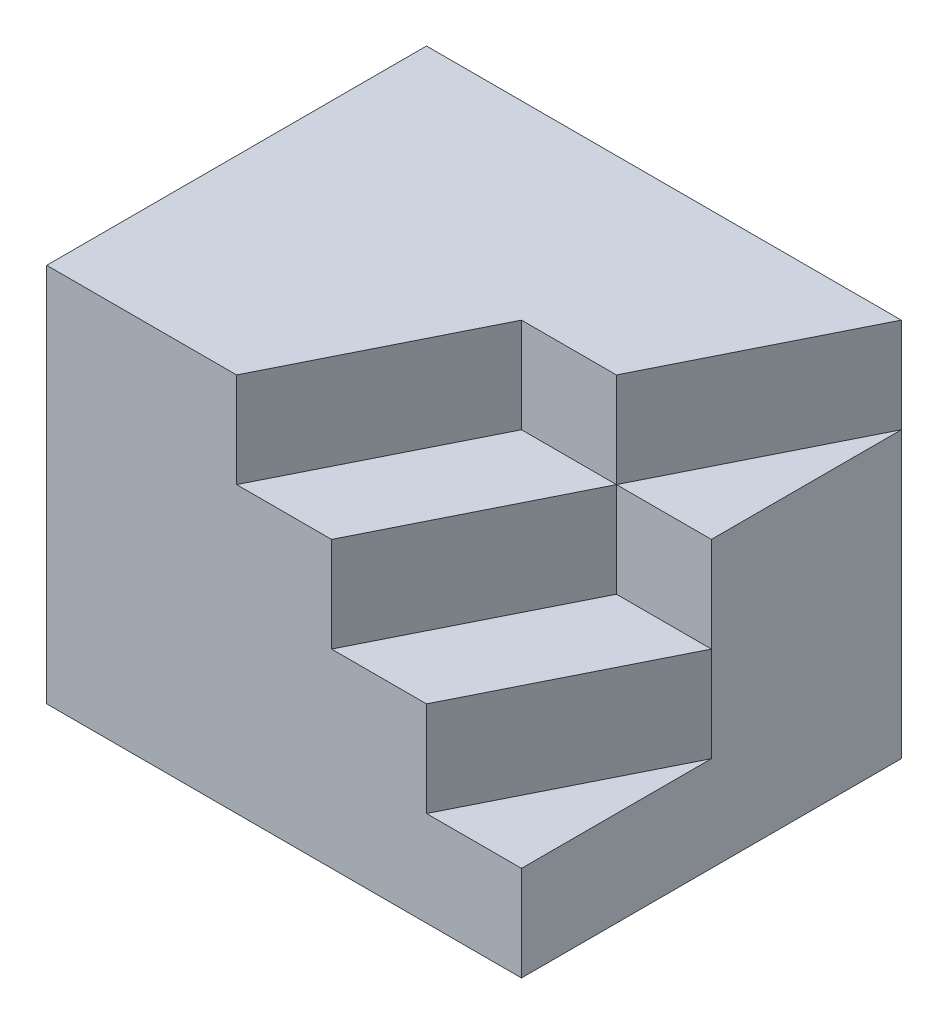
ISO-10303-21;
HEADER;
FILE_DESCRIPTION(('STEP AP214'),'2;1');
FILE_NAME('part.step','',(''),(''),'','','');
FILE_SCHEMA(('AUTOMOTIVE_DESIGN { 1 0 10303 214 1 1 1 1 }'));
ENDSEC;
DATA;
#1=APPLICATION_CONTEXT('core data for automotive mechanical design processes');
#2=APPLICATION_PROTOCOL_DEFINITION('international standard','automotive_design',2000,#1);
#3=PRODUCT_CONTEXT('',#1,'mechanical');
#4=PRODUCT('Part','Part','',(#3));
#5=PRODUCT_RELATED_PRODUCT_CATEGORY('part','',(#4));
#6=PRODUCT_DEFINITION_FORMATION('','',#4);
#7=PRODUCT_DEFINITION_CONTEXT('part definition',#1,'design');
#8=PRODUCT_DEFINITION('design','',#6,#7);
#9=PRODUCT_DEFINITION_SHAPE('','',#8);
#10=(LENGTH_UNIT() NAMED_UNIT(*) SI_UNIT(.MILLI.,.METRE.));
#11=(NAMED_UNIT(*) PLANE_ANGLE_UNIT() SI_UNIT($,.RADIAN.));
#12=(NAMED_UNIT(*) SI_UNIT($,.STERADIAN.) SOLID_ANGLE_UNIT());
#13=UNCERTAINTY_MEASURE_WITH_UNIT(LENGTH_MEASURE(1.E-05),#10,'distance_accuracy_value','');
#14=(GEOMETRIC_REPRESENTATION_CONTEXT(3) GLOBAL_UNCERTAINTY_ASSIGNED_CONTEXT((#13)) GLOBAL_UNIT_ASSIGNED_CONTEXT((#10,
#11,#12)) REPRESENTATION_CONTEXT('',''));
#15=CARTESIAN_POINT('',(0.,0.,0.));
#16=DIRECTION('',(0.,0.,1.));
#17=DIRECTION('',(1.,0.,0.));
#18=AXIS2_PLACEMENT_3D('',#15,#16,#17);
#19=CARTESIAN_POINT('',(0.,20.,0.));
#20=DIRECTION('',(0.,0.,1.));
#21=DIRECTION('',(1.,0.,0.));
#22=AXIS2_PLACEMENT_3D('',#19,#20,#21);
#23=PLANE('',#22);
#24=DIRECTION('',(0.,-1.,0.));
#25=VECTOR('',#24,1.);
#26=CARTESIAN_POINT('',(7.5,15.,0.));
#27=LINE('',#26,#25);
#28=CARTESIAN_POINT('',(7.5,15.,0.));
#29=VERTEX_POINT('',#28);
#30=CARTESIAN_POINT('',(7.5,10.,0.));
#31=VERTEX_POINT('',#30);
#32=EDGE_CURVE('E57',#29,#31,#27,.T.);
#33=ORIENTED_EDGE('',*,*,#32,.T.);
#34=DIRECTION('',(1.,0.,0.));
#35=VECTOR('',#34,1.);
#36=CARTESIAN_POINT('',(0.,10.,0.));
#37=LINE('',#36,#35);
#38=CARTESIAN_POINT('',(12.5,10.,0.));
#39=VERTEX_POINT('',#38);
#40=EDGE_CURVE('E11',#31,#39,#37,.T.);
#41=ORIENTED_EDGE('',*,*,#40,.T.);
#42=DIRECTION('',(0.,-1.,0.));
#43=VECTOR('',#42,1.);
#44=CARTESIAN_POINT('',(12.5,15.,0.));
#45=LINE('',#44,#43);
#46=CARTESIAN_POINT('',(12.5,15.,0.));
#47=VERTEX_POINT('',#46);
#48=EDGE_CURVE('E154',#47,#39,#45,.T.);
#49=ORIENTED_EDGE('',*,*,#48,.F.);
#50=DIRECTION('',(-1.,0.,0.));
#51=VECTOR('',#50,1.);
#52=CARTESIAN_POINT('',(0.,15.,0.));
#53=LINE('',#52,#51);
#54=EDGE_CURVE('E149',#47,#29,#53,.T.);
#55=ORIENTED_EDGE('',*,*,#54,.T.);
#56=EDGE_LOOP('',(#33,#41,#49,#55));
#57=FACE_BOUND('',#56,.T.);
#58=ADVANCED_FACE('F35',(#57),#23,.T.);
#59=CARTESIAN_POINT('',(0.,10.,0.));
#60=DIRECTION('',(0.,1.,0.));
#61=DIRECTION('',(0.,0.,1.));
#62=AXIS2_PLACEMENT_3D('',#59,#60,#61);
#63=PLANE('',#62);
#64=DIRECTION('',(0.447213595499958,0.,-0.894427190999916));
#65=VECTOR('',#64,1.);
#66=CARTESIAN_POINT('',(6.,10.,3.));
#67=LINE('',#66,#65);
#68=CARTESIAN_POINT('',(2.5,10.,10.));
#69=VERTEX_POINT('',#68);
#70=EDGE_CURVE('E50',#69,#31,#67,.T.);
#71=ORIENTED_EDGE('',*,*,#70,.F.);
#72=DIRECTION('',(-1.,0.,0.));
#73=VECTOR('',#72,1.);
#74=CARTESIAN_POINT('',(0.,10.,10.));
#75=LINE('',#74,#73);
#76=CARTESIAN_POINT('',(7.5,10.,10.));
#77=VERTEX_POINT('',#76);
#78=EDGE_CURVE('E127',#77,#69,#75,.T.);
#79=ORIENTED_EDGE('',*,*,#78,.F.);
#80=DIRECTION('',(0.447213595499958,0.,-0.894427190999916));
#81=VECTOR('',#80,1.);
#82=CARTESIAN_POINT('',(10.,10.,5.));
#83=LINE('',#82,#81);
#84=EDGE_CURVE('E186',#77,#39,#83,.T.);
#85=ORIENTED_EDGE('',*,*,#84,.T.);
#86=ORIENTED_EDGE('',*,*,#40,.F.);
#87=EDGE_LOOP('',(#71,#79,#85,#86));
#88=FACE_BOUND('',#87,.T.);
#89=ADVANCED_FACE('F251',(#88),#63,.T.);
#90=CARTESIAN_POINT('',(0.,5.,0.));
#91=DIRECTION('',(0.,1.,0.));
#92=DIRECTION('',(0.,0.,1.));
#93=AXIS2_PLACEMENT_3D('',#90,#91,#92);
#94=PLANE('',#93);
#95=DIRECTION('',(0.,0.,1.));
#96=VECTOR('',#95,1.);
#97=CARTESIAN_POINT('',(12.5,5.,0.));
#98=LINE('',#97,#96);
#99=CARTESIAN_POINT('',(12.5,5.,0.));
#100=VERTEX_POINT('',#99);
#101=CARTESIAN_POINT('',(12.5,5.,10.));
#102=VERTEX_POINT('',#101);
#103=EDGE_CURVE('E198',#100,#102,#98,.T.);
#104=ORIENTED_EDGE('',*,*,#103,.F.);
#105=DIRECTION('',(-0.447213595499958,0.,0.894427190999916));
#106=VECTOR('',#105,1.);
#107=CARTESIAN_POINT('',(10.,5.,5.));
#108=LINE('',#107,#106);
#109=CARTESIAN_POINT('',(7.5,5.,10.));
#110=VERTEX_POINT('',#109);
#111=EDGE_CURVE('E194',#100,#110,#108,.T.);
#112=ORIENTED_EDGE('',*,*,#111,.T.);
#113=DIRECTION('',(-1.,0.,0.));
#114=VECTOR('',#113,1.);
#115=CARTESIAN_POINT('',(0.,5.,10.));
#116=LINE('',#115,#114);
#117=EDGE_CURVE('E200',#102,#110,#116,.T.);
#118=ORIENTED_EDGE('',*,*,#117,.F.);
#119=EDGE_LOOP('',(#104,#112,#118));
#120=FACE_BOUND('',#119,.T.);
#121=ADVANCED_FACE('F255',(#120),#94,.T.);
#122=CARTESIAN_POINT('',(12.5,5.,0.));
#123=DIRECTION('',(1.,0.,0.));
#124=DIRECTION('',(0.,0.,-1.));
#125=AXIS2_PLACEMENT_3D('',#122,#123,#124);
#126=PLANE('',#125);
#127=DIRECTION('',(0.,-1.,0.));
#128=VECTOR('',#127,1.);
#129=CARTESIAN_POINT('',(12.5,5.,10.));
#130=LINE('',#129,#128);
#131=CARTESIAN_POINT('',(12.5,0.,10.));
#132=VERTEX_POINT('',#131);
#133=EDGE_CURVE('E204',#102,#132,#130,.T.);
#134=ORIENTED_EDGE('',*,*,#133,.T.);
#135=DIRECTION('',(0.,0.,1.));
#136=VECTOR('',#135,1.);
#137=CARTESIAN_POINT('',(12.5,0.,0.));
#138=LINE('',#137,#136);
#139=CARTESIAN_POINT('',(12.5,0.,-10.));
#140=VERTEX_POINT('',#139);
#141=EDGE_CURVE('E197',#140,#132,#138,.T.);
#142=ORIENTED_EDGE('',*,*,#141,.F.);
#143=DIRECTION('',(0.,-1.,0.));
#144=VECTOR('',#143,1.);
#145=CARTESIAN_POINT('',(12.5,5.,-10.));
#146=LINE('',#145,#144);
#147=CARTESIAN_POINT('',(12.5,15.,-10.));
#148=VERTEX_POINT('',#147);
#149=EDGE_CURVE('E43',#148,#140,#146,.T.);
#150=ORIENTED_EDGE('',*,*,#149,.F.);
#151=DIRECTION('',(0.,0.,1.));
#152=VECTOR('',#151,1.);
#153=CARTESIAN_POINT('',(12.5,15.,0.));
#154=LINE('',#153,#152);
#155=EDGE_CURVE('E151',#148,#47,#154,.T.);
#156=ORIENTED_EDGE('',*,*,#155,.T.);
#157=ORIENTED_EDGE('',*,*,#48,.T.);
#158=DIRECTION('',(0.,-1.,0.));
#159=VECTOR('',#158,1.);
#160=CARTESIAN_POINT('',(12.5,10.,0.));
#161=LINE('',#160,#159);
#162=EDGE_CURVE('E189',#39,#100,#161,.T.);
#163=ORIENTED_EDGE('',*,*,#162,.T.);
#164=ORIENTED_EDGE('',*,*,#103,.T.);
#165=EDGE_LOOP('',(#134,#142,#150,#156,#157,#163,#164));
#166=FACE_BOUND('',#165,.T.);
#167=ADVANCED_FACE('F37',(#166),#126,.T.);
#168=CARTESIAN_POINT('',(0.,5.,-10.));
#169=DIRECTION('',(0.,0.,1.));
#170=DIRECTION('',(1.,0.,0.));
#171=AXIS2_PLACEMENT_3D('',#168,#169,#170);
#172=PLANE('',#171);
#173=DIRECTION('',(-1.,0.,0.));
#174=VECTOR('',#173,1.);
#175=CARTESIAN_POINT('',(0.,0.,-10.));
#176=LINE('',#175,#174);
#177=CARTESIAN_POINT('',(-12.5,0.,-10.));
#178=VERTEX_POINT('',#177);
#179=EDGE_CURVE('E206',#140,#178,#176,.T.);
#180=ORIENTED_EDGE('',*,*,#179,.T.);
#181=DIRECTION('',(0.,-1.,0.));
#182=VECTOR('',#181,1.);
#183=CARTESIAN_POINT('',(-12.5,5.,-10.));
#184=LINE('',#183,#182);
#185=CARTESIAN_POINT('',(-12.5,20.,-10.));
#186=VERTEX_POINT('',#185);
#187=EDGE_CURVE('E217',#186,#178,#184,.T.);
#188=ORIENTED_EDGE('',*,*,#187,.F.);
#189=DIRECTION('',(-1.,0.,0.));
#190=VECTOR('',#189,1.);
#191=CARTESIAN_POINT('',(0.,20.,-10.));
#192=LINE('',#191,#190);
#193=CARTESIAN_POINT('',(12.5,20.,-10.));
#194=VERTEX_POINT('',#193);
#195=EDGE_CURVE('E162',#194,#186,#192,.T.);
#196=ORIENTED_EDGE('',*,*,#195,.F.);
#197=DIRECTION('',(0.,-1.,0.));
#198=VECTOR('',#197,1.);
#199=CARTESIAN_POINT('',(12.5,20.,-10.));
#200=LINE('',#199,#198);
#201=EDGE_CURVE('E179',#194,#148,#200,.T.);
#202=ORIENTED_EDGE('',*,*,#201,.T.);
#203=ORIENTED_EDGE('',*,*,#149,.T.);
#204=EDGE_LOOP('',(#180,#188,#196,#202,#203));
#205=FACE_BOUND('',#204,.T.);
#206=ADVANCED_FACE('F221',(#205),#172,.F.);
#207=CARTESIAN_POINT('',(-12.5,5.,0.));
#208=DIRECTION('',(1.,0.,0.));
#209=DIRECTION('',(0.,0.,-1.));
#210=AXIS2_PLACEMENT_3D('',#207,#208,#209);
#211=PLANE('',#210);
#212=DIRECTION('',(0.,0.,1.));
#213=VECTOR('',#212,1.);
#214=CARTESIAN_POINT('',(-12.5,0.,0.));
#215=LINE('',#214,#213);
#216=CARTESIAN_POINT('',(-12.5,0.,10.));
#217=VERTEX_POINT('',#216);
#218=EDGE_CURVE('E208',#178,#217,#215,.T.);
#219=ORIENTED_EDGE('',*,*,#218,.T.);
#220=DIRECTION('',(0.,-1.,0.));
#221=VECTOR('',#220,1.);
#222=CARTESIAN_POINT('',(-12.5,5.,10.));
#223=LINE('',#222,#221);
#224=CARTESIAN_POINT('',(-12.5,20.,10.));
#225=VERTEX_POINT('',#224);
#226=EDGE_CURVE('E214',#225,#217,#223,.T.);
#227=ORIENTED_EDGE('',*,*,#226,.F.);
#228=DIRECTION('',(0.,0.,1.));
#229=VECTOR('',#228,1.);
#230=CARTESIAN_POINT('',(-12.5,20.,0.));
#231=LINE('',#230,#229);
#232=EDGE_CURVE('E165',#186,#225,#231,.T.);
#233=ORIENTED_EDGE('',*,*,#232,.F.);
#234=ORIENTED_EDGE('',*,*,#187,.T.);
#235=EDGE_LOOP('',(#219,#227,#233,#234));
#236=FACE_BOUND('',#235,.T.);
#237=ADVANCED_FACE('F237',(#236),#211,.F.);
#238=CARTESIAN_POINT('',(0.,5.,10.));
#239=DIRECTION('',(0.,0.,1.));
#240=DIRECTION('',(1.,0.,0.));
#241=AXIS2_PLACEMENT_3D('',#238,#239,#240);
#242=PLANE('',#241);
#243=ORIENTED_EDGE('',*,*,#78,.T.);
#244=DIRECTION('',(0.,-1.,0.));
#245=VECTOR('',#244,1.);
#246=CARTESIAN_POINT('',(2.5,15.,10.));
#247=LINE('',#246,#245);
#248=CARTESIAN_POINT('',(2.5,15.,10.));
#249=VERTEX_POINT('',#248);
#250=EDGE_CURVE('E122',#249,#69,#247,.T.);
#251=ORIENTED_EDGE('',*,*,#250,.F.);
#252=DIRECTION('',(-1.,0.,0.));
#253=VECTOR('',#252,1.);
#254=CARTESIAN_POINT('',(0.,15.,10.));
#255=LINE('',#254,#253);
#256=CARTESIAN_POINT('',(-2.5,15.,10.));
#257=VERTEX_POINT('',#256);
#258=EDGE_CURVE('E126',#249,#257,#255,.T.);
#259=ORIENTED_EDGE('',*,*,#258,.T.);
#260=DIRECTION('',(0.,-1.,0.));
#261=VECTOR('',#260,1.);
#262=CARTESIAN_POINT('',(-2.5,20.,10.));
#263=LINE('',#262,#261);
#264=CARTESIAN_POINT('',(-2.5,20.,10.));
#265=VERTEX_POINT('',#264);
#266=EDGE_CURVE('E177',#265,#257,#263,.T.);
#267=ORIENTED_EDGE('',*,*,#266,.F.);
#268=DIRECTION('',(-1.,0.,0.));
#269=VECTOR('',#268,1.);
#270=CARTESIAN_POINT('',(0.,20.,10.));
#271=LINE('',#270,#269);
#272=EDGE_CURVE('E168',#265,#225,#271,.T.);
#273=ORIENTED_EDGE('',*,*,#272,.T.);
#274=ORIENTED_EDGE('',*,*,#226,.T.);
#275=DIRECTION('',(-1.,0.,0.));
#276=VECTOR('',#275,1.);
#277=CARTESIAN_POINT('',(0.,0.,10.));
#278=LINE('',#277,#276);
#279=EDGE_CURVE('E201',#132,#217,#278,.T.);
#280=ORIENTED_EDGE('',*,*,#279,.F.);
#281=ORIENTED_EDGE('',*,*,#133,.F.);
#282=ORIENTED_EDGE('',*,*,#117,.T.);
#283=DIRECTION('',(0.,-1.,0.));
#284=VECTOR('',#283,1.);
#285=CARTESIAN_POINT('',(7.5,10.,10.));
#286=LINE('',#285,#284);
#287=EDGE_CURVE('E192',#77,#110,#286,.T.);
#288=ORIENTED_EDGE('',*,*,#287,.F.);
#289=EDGE_LOOP('',(#243,#251,#259,#267,#273,#274,#280,#281,#282,#288));
#290=FACE_BOUND('',#289,.T.);
#291=ADVANCED_FACE('F124',(#290),#242,.T.);
#292=CARTESIAN_POINT('',(0.,0.,0.));
#293=DIRECTION('',(0.,1.,0.));
#294=DIRECTION('',(0.,0.,1.));
#295=AXIS2_PLACEMENT_3D('',#292,#293,#294);
#296=PLANE('',#295);
#297=ORIENTED_EDGE('',*,*,#279,.T.);
#298=ORIENTED_EDGE('',*,*,#218,.F.);
#299=ORIENTED_EDGE('',*,*,#179,.F.);
#300=ORIENTED_EDGE('',*,*,#141,.T.);
#301=EDGE_LOOP('',(#297,#298,#299,#300));
#302=FACE_BOUND('',#301,.T.);
#303=ADVANCED_FACE('F229',(#302),#296,.F.);
#304=CARTESIAN_POINT('',(10.,10.,5.));
#305=DIRECTION('',(-0.894427190999916,0.,-0.447213595499958));
#306=DIRECTION('',(-0.447213595499958,0.,0.894427190999916));
#307=AXIS2_PLACEMENT_3D('',#304,#305,#306);
#308=PLANE('',#307);
#309=ORIENTED_EDGE('',*,*,#111,.F.);
#310=ORIENTED_EDGE('',*,*,#162,.F.);
#311=ORIENTED_EDGE('',*,*,#84,.F.);
#312=ORIENTED_EDGE('',*,*,#287,.T.);
#313=EDGE_LOOP('',(#309,#310,#311,#312));
#314=FACE_BOUND('',#313,.T.);
#315=ADVANCED_FACE('F253',(#314),#308,.F.);
#316=DIRECTION('',(-1.,0.,0.));
#317=VECTOR('',#316,1.);
#318=CARTESIAN_POINT('',(0.,15.,0.));
#319=LINE('',#318,#317);
#320=CARTESIAN_POINT('',(2.5,15.,0.));
#321=VERTEX_POINT('',#320);
#322=EDGE_CURVE('E139',#29,#321,#319,.T.);
#323=ORIENTED_EDGE('',*,*,#322,.F.);
#324=DIRECTION('',(0.,-1.,0.));
#325=VECTOR('',#324,1.);
#326=CARTESIAN_POINT('',(7.5,20.,0.));
#327=LINE('',#326,#325);
#328=CARTESIAN_POINT('',(7.5,20.,0.));
#329=VERTEX_POINT('',#328);
#330=EDGE_CURVE('E182',#329,#29,#327,.T.);
#331=ORIENTED_EDGE('',*,*,#330,.F.);
#332=DIRECTION('',(-1.,0.,0.));
#333=VECTOR('',#332,1.);
#334=CARTESIAN_POINT('',(0.,20.,0.));
#335=LINE('',#334,#333);
#336=CARTESIAN_POINT('',(2.5,20.,0.));
#337=VERTEX_POINT('',#336);
#338=EDGE_CURVE('E157',#329,#337,#335,.T.);
#339=ORIENTED_EDGE('',*,*,#338,.T.);
#340=DIRECTION('',(0.,-1.,0.));
#341=VECTOR('',#340,1.);
#342=CARTESIAN_POINT('',(2.5,20.,0.));
#343=LINE('',#342,#341);
#344=EDGE_CURVE('E174',#337,#321,#343,.T.);
#345=ORIENTED_EDGE('',*,*,#344,.T.);
#346=EDGE_LOOP('',(#323,#331,#339,#345));
#347=FACE_BOUND('',#346,.T.);
#348=ADVANCED_FACE('F267',(#347),#23,.T.);
#349=CARTESIAN_POINT('',(6.,20.,3.));
#350=DIRECTION('',(-0.894427190999916,0.,-0.447213595499958));
#351=DIRECTION('',(-0.447213595499958,0.,0.894427190999916));
#352=AXIS2_PLACEMENT_3D('',#349,#350,#351);
#353=PLANE('',#352);
#354=ORIENTED_EDGE('',*,*,#330,.T.);
#355=DIRECTION('',(0.447213595499958,0.,-0.894427190999916));
#356=VECTOR('',#355,1.);
#357=CARTESIAN_POINT('',(6.,15.,3.));
#358=LINE('',#357,#356);
#359=EDGE_CURVE('E146',#29,#148,#358,.T.);
#360=ORIENTED_EDGE('',*,*,#359,.T.);
#361=ORIENTED_EDGE('',*,*,#201,.F.);
#362=DIRECTION('',(0.447213595499958,0.,-0.894427190999916));
#363=VECTOR('',#362,1.);
#364=CARTESIAN_POINT('',(6.,20.,3.));
#365=LINE('',#364,#363);
#366=EDGE_CURVE('E160',#329,#194,#365,.T.);
#367=ORIENTED_EDGE('',*,*,#366,.F.);
#368=EDGE_LOOP('',(#354,#360,#361,#367));
#369=FACE_BOUND('',#368,.T.);
#370=ADVANCED_FACE('F244',(#369),#353,.F.);
#371=CARTESIAN_POINT('',(2.,20.,0.999999999999999));
#372=DIRECTION('',(0.894427190999916,0.,0.447213595499958));
#373=DIRECTION('',(0.447213595499958,0.,-0.894427190999916));
#374=AXIS2_PLACEMENT_3D('',#371,#372,#373);
#375=PLANE('',#374);
#376=DIRECTION('',(-0.447213595499958,0.,0.894427190999916));
#377=VECTOR('',#376,1.);
#378=CARTESIAN_POINT('',(2.,15.,0.999999999999999));
#379=LINE('',#378,#377);
#380=EDGE_CURVE('E138',#321,#257,#379,.T.);
#381=ORIENTED_EDGE('',*,*,#380,.F.);
#382=ORIENTED_EDGE('',*,*,#344,.F.);
#383=DIRECTION('',(-0.447213595499958,0.,0.894427190999916));
#384=VECTOR('',#383,1.);
#385=CARTESIAN_POINT('',(2.,20.,0.999999999999999));
#386=LINE('',#385,#384);
#387=EDGE_CURVE('E171',#337,#265,#386,.T.);
#388=ORIENTED_EDGE('',*,*,#387,.T.);
#389=ORIENTED_EDGE('',*,*,#266,.T.);
#390=EDGE_LOOP('',(#381,#382,#388,#389));
#391=FACE_BOUND('',#390,.T.);
#392=ADVANCED_FACE('F277',(#391),#375,.T.);
#393=CARTESIAN_POINT('',(0.,20.,0.));
#394=DIRECTION('',(0.,1.,0.));
#395=DIRECTION('',(0.,0.,1.));
#396=AXIS2_PLACEMENT_3D('',#393,#394,#395);
#397=PLANE('',#396);
#398=ORIENTED_EDGE('',*,*,#338,.F.);
#399=ORIENTED_EDGE('',*,*,#366,.T.);
#400=ORIENTED_EDGE('',*,*,#195,.T.);
#401=ORIENTED_EDGE('',*,*,#232,.T.);
#402=ORIENTED_EDGE('',*,*,#272,.F.);
#403=ORIENTED_EDGE('',*,*,#387,.F.);
#404=EDGE_LOOP('',(#398,#399,#400,#401,#402,#403));
#405=FACE_BOUND('',#404,.T.);
#406=ADVANCED_FACE('F240',(#405),#397,.T.);
#407=CARTESIAN_POINT('',(0.,15.,0.));
#408=DIRECTION('',(0.,1.,0.));
#409=DIRECTION('',(0.,0.,1.));
#410=AXIS2_PLACEMENT_3D('',#407,#408,#409);
#411=PLANE('',#410);
#412=ORIENTED_EDGE('',*,*,#359,.F.);
#413=ORIENTED_EDGE('',*,*,#54,.F.);
#414=ORIENTED_EDGE('',*,*,#155,.F.);
#415=EDGE_LOOP('',(#412,#413,#414));
#416=FACE_BOUND('',#415,.T.);
#417=ADVANCED_FACE('F248',(#416),#411,.T.);
#418=CARTESIAN_POINT('',(6.,15.,3.));
#419=DIRECTION('',(0.894427190999916,0.,0.447213595499958));
#420=DIRECTION('',(0.447213595499958,0.,-0.894427190999916));
#421=AXIS2_PLACEMENT_3D('',#418,#419,#420);
#422=PLANE('',#421);
#423=ORIENTED_EDGE('',*,*,#250,.T.);
#424=ORIENTED_EDGE('',*,*,#70,.T.);
#425=ORIENTED_EDGE('',*,*,#32,.F.);
#426=DIRECTION('',(-0.447213595499958,0.,0.894427190999916));
#427=VECTOR('',#426,1.);
#428=CARTESIAN_POINT('',(6.,15.,3.));
#429=LINE('',#428,#427);
#430=EDGE_CURVE('E129',#29,#249,#429,.T.);
#431=ORIENTED_EDGE('',*,*,#430,.T.);
#432=EDGE_LOOP('',(#423,#424,#425,#431));
#433=FACE_BOUND('',#432,.T.);
#434=ADVANCED_FACE('F132',(#433),#422,.T.);
#435=CARTESIAN_POINT('',(0.,15.,0.));
#436=DIRECTION('',(0.,1.,0.));
#437=DIRECTION('',(0.,0.,1.));
#438=AXIS2_PLACEMENT_3D('',#435,#436,#437);
#439=PLANE('',#438);
#440=ORIENTED_EDGE('',*,*,#430,.F.);
#441=ORIENTED_EDGE('',*,*,#322,.T.);
#442=ORIENTED_EDGE('',*,*,#380,.T.);
#443=ORIENTED_EDGE('',*,*,#258,.F.);
#444=EDGE_LOOP('',(#440,#441,#442,#443));
#445=FACE_BOUND('',#444,.T.);
#446=ADVANCED_FACE('F137',(#445),#439,.T.);
#447=CLOSED_SHELL('',(#58,#89,#121,#167,#206,#237,#291,#303,#315,#348,#370,#392,#406,#417,#434,#446));
#448=MANIFOLD_SOLID_BREP('B2',#447);
#449=ADVANCED_BREP_SHAPE_REPRESENTATION('',(#18,#448),#14);
#450=SHAPE_DEFINITION_REPRESENTATION(#9,#449);
ENDSEC;
END-ISO-10303-21;
